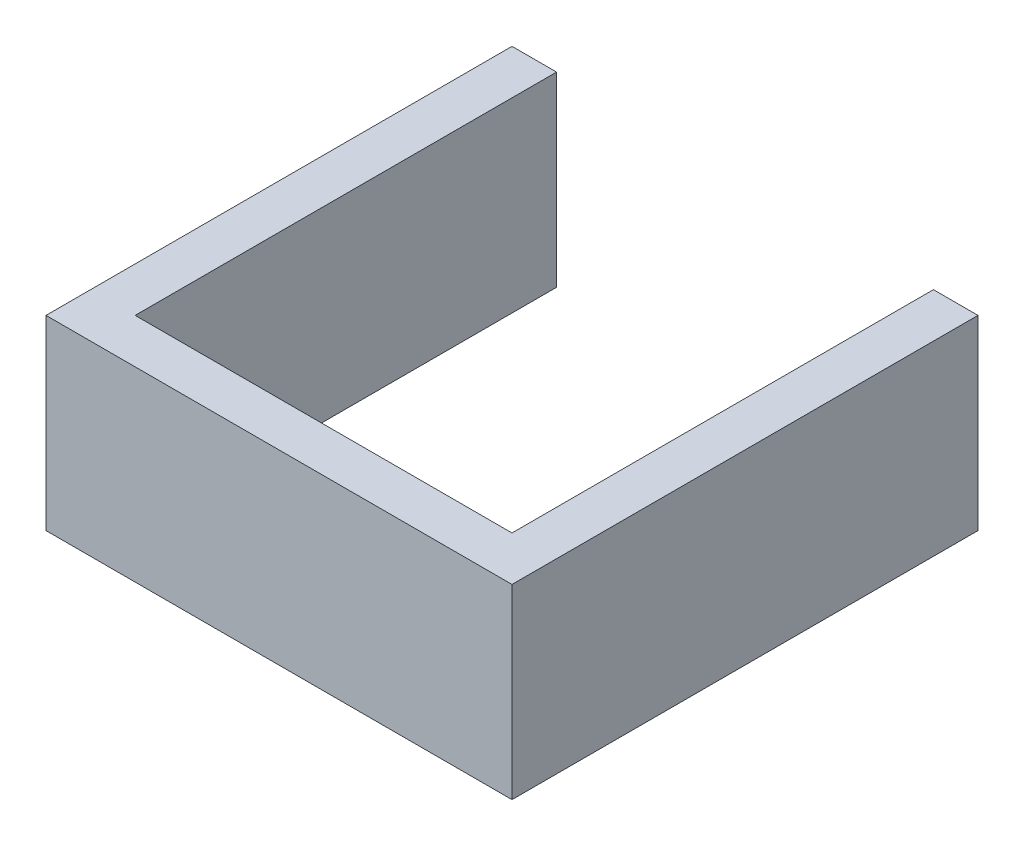
ISO-10303-21;
HEADER;
FILE_DESCRIPTION(('STEP AP214'),'2;1');
FILE_NAME('part.step','',(''),(''),'','','');
FILE_SCHEMA(('AUTOMOTIVE_DESIGN { 1 0 10303 214 1 1 1 1 }'));
ENDSEC;
DATA;
#1=APPLICATION_CONTEXT('core data for automotive mechanical design processes');
#2=APPLICATION_PROTOCOL_DEFINITION('international standard','automotive_design',2000,#1);
#3=PRODUCT_CONTEXT('',#1,'mechanical');
#4=PRODUCT('Part','Part','',(#3));
#5=PRODUCT_RELATED_PRODUCT_CATEGORY('part','',(#4));
#6=PRODUCT_DEFINITION_FORMATION('','',#4);
#7=PRODUCT_DEFINITION_CONTEXT('part definition',#1,'design');
#8=PRODUCT_DEFINITION('design','',#6,#7);
#9=PRODUCT_DEFINITION_SHAPE('','',#8);
#10=(LENGTH_UNIT() NAMED_UNIT(*) SI_UNIT(.MILLI.,.METRE.));
#11=(NAMED_UNIT(*) PLANE_ANGLE_UNIT() SI_UNIT($,.RADIAN.));
#12=(NAMED_UNIT(*) SI_UNIT($,.STERADIAN.) SOLID_ANGLE_UNIT());
#13=UNCERTAINTY_MEASURE_WITH_UNIT(LENGTH_MEASURE(1.E-05),#10,'distance_accuracy_value','');
#14=(GEOMETRIC_REPRESENTATION_CONTEXT(3) GLOBAL_UNCERTAINTY_ASSIGNED_CONTEXT((#13)) GLOBAL_UNIT_ASSIGNED_CONTEXT((#10,
#11,#12)) REPRESENTATION_CONTEXT('',''));
#15=CARTESIAN_POINT('',(0.,0.,0.));
#16=DIRECTION('',(0.,0.,1.));
#17=DIRECTION('',(1.,0.,0.));
#18=AXIS2_PLACEMENT_3D('',#15,#16,#17);
#19=CARTESIAN_POINT('',(-22.01,-0.01,230.));
#20=DIRECTION('',(0.,0.,1.));
#21=DIRECTION('',(1.,0.,0.));
#22=AXIS2_PLACEMENT_3D('',#19,#20,#21);
#23=PLANE('',#22);
#24=DIRECTION('',(1.,0.,0.));
#25=VECTOR('',#24,1.);
#26=CARTESIAN_POINT('',(93.,92.,230.));
#27=LINE('',#26,#25);
#28=CARTESIAN_POINT('',(-22.,92.,230.));
#29=VERTEX_POINT('',#28);
#30=CARTESIAN_POINT('',(208.,92.,230.));
#31=VERTEX_POINT('',#30);
#32=EDGE_CURVE('E136',#29,#31,#27,.T.);
#33=ORIENTED_EDGE('',*,*,#32,.F.);
#34=DIRECTION('',(0.,1.,0.));
#35=VECTOR('',#34,1.);
#36=CARTESIAN_POINT('',(-22.,46.,230.));
#37=LINE('',#36,#35);
#38=CARTESIAN_POINT('',(-22.,0.,230.));
#39=VERTEX_POINT('',#38);
#40=EDGE_CURVE('E125',#39,#29,#37,.T.);
#41=ORIENTED_EDGE('',*,*,#40,.F.);
#42=DIRECTION('',(-1.,0.,0.));
#43=VECTOR('',#42,1.);
#44=CARTESIAN_POINT('',(93.,0.,230.));
#45=LINE('',#44,#43);
#46=CARTESIAN_POINT('',(208.,0.,230.));
#47=VERTEX_POINT('',#46);
#48=EDGE_CURVE('E124',#47,#39,#45,.T.);
#49=ORIENTED_EDGE('',*,*,#48,.F.);
#50=DIRECTION('',(0.,-1.,0.));
#51=VECTOR('',#50,1.);
#52=CARTESIAN_POINT('',(208.,46.,230.));
#53=LINE('',#52,#51);
#54=EDGE_CURVE('E21',#31,#47,#53,.T.);
#55=ORIENTED_EDGE('',*,*,#54,.F.);
#56=EDGE_LOOP('',(#33,#41,#49,#55));
#57=FACE_BOUND('',#56,.T.);
#58=ADVANCED_FACE('F17',(#57),#23,.T.);
#59=CARTESIAN_POINT('',(208.,-0.01,230.01));
#60=DIRECTION('',(1.,0.,0.));
#61=DIRECTION('',(0.,0.,-1.));
#62=AXIS2_PLACEMENT_3D('',#59,#60,#61);
#63=PLANE('',#62);
#64=DIRECTION('',(0.,0.,-1.));
#65=VECTOR('',#64,1.);
#66=CARTESIAN_POINT('',(208.,92.,115.));
#67=LINE('',#66,#65);
#68=CARTESIAN_POINT('',(208.,92.,0.));
#69=VERTEX_POINT('',#68);
#70=EDGE_CURVE('E119',#31,#69,#67,.T.);
#71=ORIENTED_EDGE('',*,*,#70,.F.);
#72=ORIENTED_EDGE('',*,*,#54,.T.);
#73=DIRECTION('',(0.,0.,1.));
#74=VECTOR('',#73,1.);
#75=CARTESIAN_POINT('',(208.,0.,115.));
#76=LINE('',#75,#74);
#77=CARTESIAN_POINT('',(208.,0.,0.));
#78=VERTEX_POINT('',#77);
#79=EDGE_CURVE('E117',#78,#47,#76,.T.);
#80=ORIENTED_EDGE('',*,*,#79,.F.);
#81=DIRECTION('',(0.,-1.,0.));
#82=VECTOR('',#81,1.);
#83=CARTESIAN_POINT('',(208.,46.,0.));
#84=LINE('',#83,#82);
#85=EDGE_CURVE('E109',#69,#78,#84,.T.);
#86=ORIENTED_EDGE('',*,*,#85,.F.);
#87=EDGE_LOOP('',(#71,#72,#80,#86));
#88=FACE_BOUND('',#87,.T.);
#89=ADVANCED_FACE('F116',(#88),#63,.T.);
#90=CARTESIAN_POINT('',(208.01,-0.01,0.));
#91=DIRECTION('',(0.,0.,-1.));
#92=DIRECTION('',(-1.,0.,0.));
#93=AXIS2_PLACEMENT_3D('',#90,#91,#92);
#94=PLANE('',#93);
#95=DIRECTION('',(-1.,0.,0.));
#96=VECTOR('',#95,1.);
#97=CARTESIAN_POINT('',(93.,92.,0.));
#98=LINE('',#97,#96);
#99=CARTESIAN_POINT('',(186.,92.,0.));
#100=VERTEX_POINT('',#99);
#101=EDGE_CURVE('E139',#69,#100,#98,.T.);
#102=ORIENTED_EDGE('',*,*,#101,.F.);
#103=ORIENTED_EDGE('',*,*,#85,.T.);
#104=DIRECTION('',(1.,0.,0.));
#105=VECTOR('',#104,1.);
#106=CARTESIAN_POINT('',(93.,0.,0.));
#107=LINE('',#106,#105);
#108=CARTESIAN_POINT('',(186.,0.,0.));
#109=VERTEX_POINT('',#108);
#110=EDGE_CURVE('E99',#109,#78,#107,.T.);
#111=ORIENTED_EDGE('',*,*,#110,.F.);
#112=DIRECTION('',(0.,-1.,0.));
#113=VECTOR('',#112,1.);
#114=CARTESIAN_POINT('',(186.,46.,0.));
#115=LINE('',#114,#113);
#116=EDGE_CURVE('E80',#100,#109,#115,.T.);
#117=ORIENTED_EDGE('',*,*,#116,.F.);
#118=EDGE_LOOP('',(#102,#103,#111,#117));
#119=FACE_BOUND('',#118,.T.);
#120=ADVANCED_FACE('F179',(#119),#94,.T.);
#121=CARTESIAN_POINT('',(186.,-0.01,-0.00999999999997335));
#122=DIRECTION('',(-1.,0.,0.));
#123=DIRECTION('',(0.,0.,1.));
#124=AXIS2_PLACEMENT_3D('',#121,#122,#123);
#125=PLANE('',#124);
#126=DIRECTION('',(0.,0.,1.));
#127=VECTOR('',#126,1.);
#128=CARTESIAN_POINT('',(186.,92.,115.));
#129=LINE('',#128,#127);
#130=CARTESIAN_POINT('',(186.,92.,208.));
#131=VERTEX_POINT('',#130);
#132=EDGE_CURVE('E142',#100,#131,#129,.T.);
#133=ORIENTED_EDGE('',*,*,#132,.F.);
#134=ORIENTED_EDGE('',*,*,#116,.T.);
#135=DIRECTION('',(0.,0.,-1.));
#136=VECTOR('',#135,1.);
#137=CARTESIAN_POINT('',(186.,0.,115.));
#138=LINE('',#137,#136);
#139=CARTESIAN_POINT('',(186.,0.,208.));
#140=VERTEX_POINT('',#139);
#141=EDGE_CURVE('E95',#140,#109,#138,.T.);
#142=ORIENTED_EDGE('',*,*,#141,.F.);
#143=DIRECTION('',(0.,-1.,0.));
#144=VECTOR('',#143,1.);
#145=CARTESIAN_POINT('',(186.,46.,208.));
#146=LINE('',#145,#144);
#147=EDGE_CURVE('E85',#131,#140,#146,.T.);
#148=ORIENTED_EDGE('',*,*,#147,.F.);
#149=EDGE_LOOP('',(#133,#134,#142,#148));
#150=FACE_BOUND('',#149,.T.);
#151=ADVANCED_FACE('F96',(#150),#125,.T.);
#152=CARTESIAN_POINT('',(186.01,-0.01,208.));
#153=DIRECTION('',(0.,0.,-1.));
#154=DIRECTION('',(-1.,0.,0.));
#155=AXIS2_PLACEMENT_3D('',#152,#153,#154);
#156=PLANE('',#155);
#157=DIRECTION('',(-1.,0.,0.));
#158=VECTOR('',#157,1.);
#159=CARTESIAN_POINT('',(93.,92.,208.));
#160=LINE('',#159,#158);
#161=CARTESIAN_POINT('',(0.,92.,208.));
#162=VERTEX_POINT('',#161);
#163=EDGE_CURVE('E91',#131,#162,#160,.T.);
#164=ORIENTED_EDGE('',*,*,#163,.F.);
#165=ORIENTED_EDGE('',*,*,#147,.T.);
#166=DIRECTION('',(1.,0.,0.));
#167=VECTOR('',#166,1.);
#168=CARTESIAN_POINT('',(93.,0.,208.));
#169=LINE('',#168,#167);
#170=CARTESIAN_POINT('',(0.,0.,208.));
#171=VERTEX_POINT('',#170);
#172=EDGE_CURVE('E89',#171,#140,#169,.T.);
#173=ORIENTED_EDGE('',*,*,#172,.F.);
#174=DIRECTION('',(0.,-1.,0.));
#175=VECTOR('',#174,1.);
#176=CARTESIAN_POINT('',(0.,46.,208.));
#177=LINE('',#176,#175);
#178=EDGE_CURVE('E147',#162,#171,#177,.T.);
#179=ORIENTED_EDGE('',*,*,#178,.F.);
#180=EDGE_LOOP('',(#164,#165,#173,#179));
#181=FACE_BOUND('',#180,.T.);
#182=ADVANCED_FACE('F86',(#181),#156,.T.);
#183=CARTESIAN_POINT('',(208.01,0.,230.01));
#184=DIRECTION('',(0.,-1.,0.));
#185=DIRECTION('',(-1.,0.,0.));
#186=AXIS2_PLACEMENT_3D('',#183,#184,#185);
#187=PLANE('',#186);
#188=ORIENTED_EDGE('',*,*,#79,.T.);
#189=ORIENTED_EDGE('',*,*,#48,.T.);
#190=DIRECTION('',(0.,0.,1.));
#191=VECTOR('',#190,1.);
#192=CARTESIAN_POINT('',(-22.,0.,115.));
#193=LINE('',#192,#191);
#194=CARTESIAN_POINT('',(-22.,0.,0.));
#195=VERTEX_POINT('',#194);
#196=EDGE_CURVE('E127',#195,#39,#193,.T.);
#197=ORIENTED_EDGE('',*,*,#196,.F.);
#198=DIRECTION('',(-1.,0.,0.));
#199=VECTOR('',#198,1.);
#200=CARTESIAN_POINT('',(-11.,0.,0.));
#201=LINE('',#200,#199);
#202=CARTESIAN_POINT('',(0.,0.,0.));
#203=VERTEX_POINT('',#202);
#204=EDGE_CURVE('E149',#203,#195,#201,.T.);
#205=ORIENTED_EDGE('',*,*,#204,.F.);
#206=DIRECTION('',(0.,0.,-1.));
#207=VECTOR('',#206,1.);
#208=CARTESIAN_POINT('',(0.,0.,104.));
#209=LINE('',#208,#207);
#210=EDGE_CURVE('E104',#171,#203,#209,.T.);
#211=ORIENTED_EDGE('',*,*,#210,.F.);
#212=ORIENTED_EDGE('',*,*,#172,.T.);
#213=ORIENTED_EDGE('',*,*,#141,.T.);
#214=ORIENTED_EDGE('',*,*,#110,.T.);
#215=EDGE_LOOP('',(#188,#189,#197,#205,#211,#212,#213,#214));
#216=FACE_BOUND('',#215,.T.);
#217=ADVANCED_FACE('F102',(#216),#187,.T.);
#218=CARTESIAN_POINT('',(-22.,-0.01,-0.01));
#219=DIRECTION('',(-1.,0.,0.));
#220=DIRECTION('',(0.,0.,1.));
#221=AXIS2_PLACEMENT_3D('',#218,#219,#220);
#222=PLANE('',#221);
#223=DIRECTION('',(0.,0.,1.));
#224=VECTOR('',#223,1.);
#225=CARTESIAN_POINT('',(-22.,92.,115.));
#226=LINE('',#225,#224);
#227=CARTESIAN_POINT('',(-22.,92.,0.));
#228=VERTEX_POINT('',#227);
#229=EDGE_CURVE('E133',#228,#29,#226,.T.);
#230=ORIENTED_EDGE('',*,*,#229,.F.);
#231=DIRECTION('',(0.,1.,0.));
#232=VECTOR('',#231,1.);
#233=CARTESIAN_POINT('',(-22.,46.,0.));
#234=LINE('',#233,#232);
#235=EDGE_CURVE('E152',#195,#228,#234,.T.);
#236=ORIENTED_EDGE('',*,*,#235,.F.);
#237=ORIENTED_EDGE('',*,*,#196,.T.);
#238=ORIENTED_EDGE('',*,*,#40,.T.);
#239=EDGE_LOOP('',(#230,#236,#237,#238));
#240=FACE_BOUND('',#239,.T.);
#241=ADVANCED_FACE('F160',(#240),#222,.T.);
#242=CARTESIAN_POINT('',(-22.01,92.,-0.00999999999999446));
#243=DIRECTION('',(0.,1.,0.));
#244=DIRECTION('',(0.,0.,1.));
#245=AXIS2_PLACEMENT_3D('',#242,#243,#244);
#246=PLANE('',#245);
#247=DIRECTION('',(0.,0.,1.));
#248=VECTOR('',#247,1.);
#249=CARTESIAN_POINT('',(0.,92.,104.));
#250=LINE('',#249,#248);
#251=CARTESIAN_POINT('',(0.,92.,0.));
#252=VERTEX_POINT('',#251);
#253=EDGE_CURVE('E36',#252,#162,#250,.T.);
#254=ORIENTED_EDGE('',*,*,#253,.F.);
#255=DIRECTION('',(1.,0.,0.));
#256=VECTOR('',#255,1.);
#257=CARTESIAN_POINT('',(-11.,92.,0.));
#258=LINE('',#257,#256);
#259=EDGE_CURVE('E27',#228,#252,#258,.T.);
#260=ORIENTED_EDGE('',*,*,#259,.F.);
#261=ORIENTED_EDGE('',*,*,#229,.T.);
#262=ORIENTED_EDGE('',*,*,#32,.T.);
#263=ORIENTED_EDGE('',*,*,#70,.T.);
#264=ORIENTED_EDGE('',*,*,#101,.T.);
#265=ORIENTED_EDGE('',*,*,#132,.T.);
#266=ORIENTED_EDGE('',*,*,#163,.T.);
#267=EDGE_LOOP('',(#254,#260,#261,#262,#263,#264,#265,#266));
#268=FACE_BOUND('',#267,.T.);
#269=ADVANCED_FACE('F158',(#268),#246,.T.);
#270=CARTESIAN_POINT('',(0.,-0.01,208.01));
#271=DIRECTION('',(1.,0.,0.));
#272=DIRECTION('',(0.,0.,-1.));
#273=AXIS2_PLACEMENT_3D('',#270,#271,#272);
#274=PLANE('',#273);
#275=ORIENTED_EDGE('',*,*,#253,.T.);
#276=ORIENTED_EDGE('',*,*,#178,.T.);
#277=ORIENTED_EDGE('',*,*,#210,.T.);
#278=DIRECTION('',(0.,-1.,0.));
#279=VECTOR('',#278,1.);
#280=CARTESIAN_POINT('',(0.,46.,0.));
#281=LINE('',#280,#279);
#282=EDGE_CURVE('E11',#252,#203,#281,.T.);
#283=ORIENTED_EDGE('',*,*,#282,.F.);
#284=EDGE_LOOP('',(#275,#276,#277,#283));
#285=FACE_BOUND('',#284,.T.);
#286=ADVANCED_FACE('F162',(#285),#274,.T.);
#287=CARTESIAN_POINT('',(0.01,-0.01,0.));
#288=DIRECTION('',(0.,0.,-1.));
#289=DIRECTION('',(-1.,0.,0.));
#290=AXIS2_PLACEMENT_3D('',#287,#288,#289);
#291=PLANE('',#290);
#292=ORIENTED_EDGE('',*,*,#259,.T.);
#293=ORIENTED_EDGE('',*,*,#282,.T.);
#294=ORIENTED_EDGE('',*,*,#204,.T.);
#295=ORIENTED_EDGE('',*,*,#235,.T.);
#296=EDGE_LOOP('',(#292,#293,#294,#295));
#297=FACE_BOUND('',#296,.T.);
#298=ADVANCED_FACE('F19',(#297),#291,.T.);
#299=CLOSED_SHELL('',(#58,#89,#120,#151,#182,#217,#241,#269,#286,#298));
#300=MANIFOLD_SOLID_BREP('B1',#299);
#301=ADVANCED_BREP_SHAPE_REPRESENTATION('',(#18,#300),#14);
#302=SHAPE_DEFINITION_REPRESENTATION(#9,#301);
ENDSEC;
END-ISO-10303-21;
